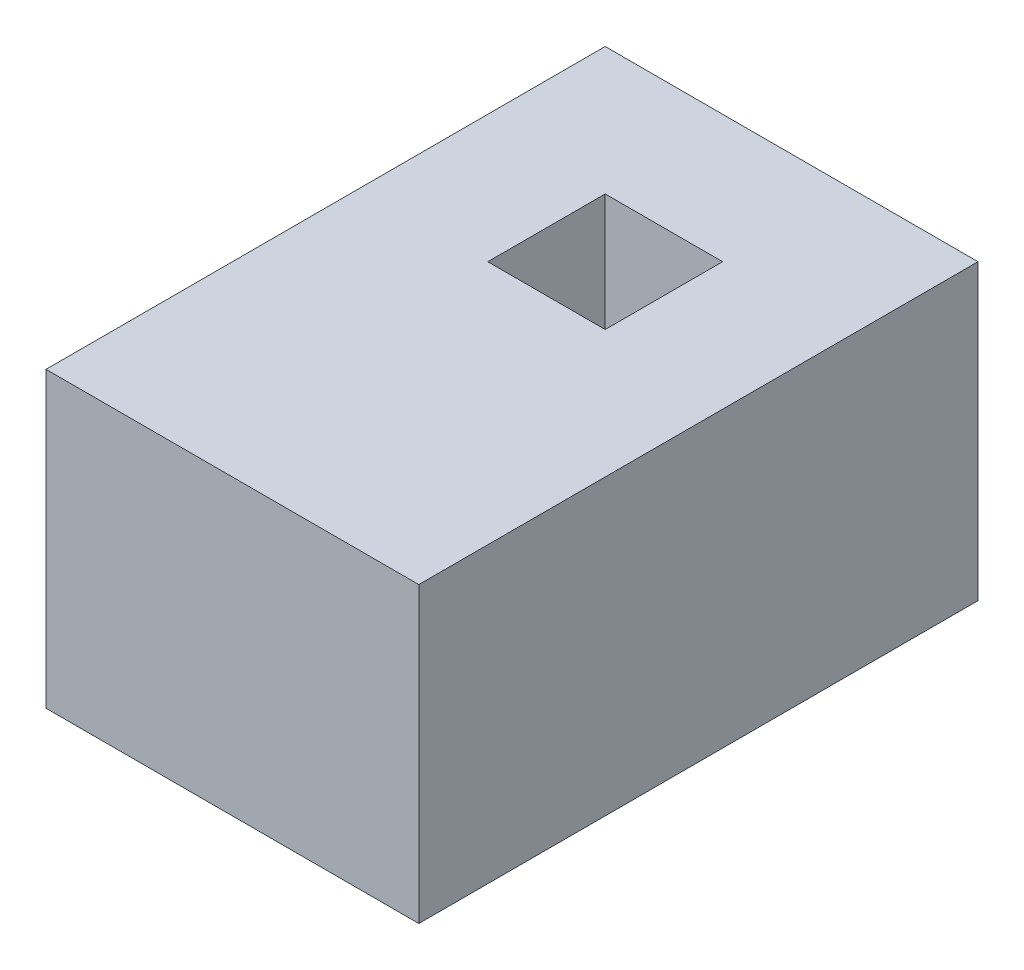
ISO-10303-21;
HEADER;
FILE_DESCRIPTION(('STEP AP214'),'2;1');
FILE_NAME('part.step','',(''),(''),'','','');
FILE_SCHEMA(('AUTOMOTIVE_DESIGN { 1 0 10303 214 1 1 1 1 }'));
ENDSEC;
DATA;
#1=APPLICATION_CONTEXT('core data for automotive mechanical design processes');
#2=APPLICATION_PROTOCOL_DEFINITION('international standard','automotive_design',2000,#1);
#3=PRODUCT_CONTEXT('',#1,'mechanical');
#4=PRODUCT('Part','Part','',(#3));
#5=PRODUCT_RELATED_PRODUCT_CATEGORY('part','',(#4));
#6=PRODUCT_DEFINITION_FORMATION('','',#4);
#7=PRODUCT_DEFINITION_CONTEXT('part definition',#1,'design');
#8=PRODUCT_DEFINITION('design','',#6,#7);
#9=PRODUCT_DEFINITION_SHAPE('','',#8);
#10=(LENGTH_UNIT() NAMED_UNIT(*) SI_UNIT(.MILLI.,.METRE.));
#11=(NAMED_UNIT(*) PLANE_ANGLE_UNIT() SI_UNIT($,.RADIAN.));
#12=(NAMED_UNIT(*) SI_UNIT($,.STERADIAN.) SOLID_ANGLE_UNIT());
#13=UNCERTAINTY_MEASURE_WITH_UNIT(LENGTH_MEASURE(1.E-05),#10,'distance_accuracy_value','');
#14=(GEOMETRIC_REPRESENTATION_CONTEXT(3) GLOBAL_UNCERTAINTY_ASSIGNED_CONTEXT((#13)) GLOBAL_UNIT_ASSIGNED_CONTEXT((#10,
#11,#12)) REPRESENTATION_CONTEXT('',''));
#15=CARTESIAN_POINT('',(0.,0.,0.));
#16=DIRECTION('',(0.,0.,1.));
#17=DIRECTION('',(1.,0.,0.));
#18=AXIS2_PLACEMENT_3D('',#15,#16,#17);
#19=CARTESIAN_POINT('',(0.,1.,0.));
#20=DIRECTION('',(0.,-1.,0.));
#21=DIRECTION('',(0.,0.,-1.));
#22=AXIS2_PLACEMENT_3D('',#19,#20,#21);
#23=PLANE('',#22);
#24=DIRECTION('',(0.,0.,-1.));
#25=VECTOR('',#24,1.);
#26=CARTESIAN_POINT('',(0.634999999999997,1.,0.952499999999988));
#27=LINE('',#26,#25);
#28=CARTESIAN_POINT('',(0.634999999999997,1.,0.952499999999988));
#29=VERTEX_POINT('',#28);
#30=CARTESIAN_POINT('',(0.634999999999997,1.,-0.952500000000002));
#31=VERTEX_POINT('',#30);
#32=EDGE_CURVE('E134',#29,#31,#27,.T.);
#33=ORIENTED_EDGE('',*,*,#32,.T.);
#34=DIRECTION('',(-1.,0.,0.));
#35=VECTOR('',#34,1.);
#36=CARTESIAN_POINT('',(-0.635000000000003,1.,-0.952500000000002));
#37=LINE('',#36,#35);
#38=CARTESIAN_POINT('',(-0.635000000000003,1.,-0.952500000000002));
#39=VERTEX_POINT('',#38);
#40=EDGE_CURVE('E137',#31,#39,#37,.T.);
#41=ORIENTED_EDGE('',*,*,#40,.T.);
#42=DIRECTION('',(0.,0.,1.));
#43=VECTOR('',#42,1.);
#44=CARTESIAN_POINT('',(-0.635000000000003,1.,0.952499999999988));
#45=LINE('',#44,#43);
#46=CARTESIAN_POINT('',(-0.635000000000003,1.,0.952499999999988));
#47=VERTEX_POINT('',#46);
#48=EDGE_CURVE('E140',#39,#47,#45,.T.);
#49=ORIENTED_EDGE('',*,*,#48,.T.);
#50=DIRECTION('',(1.,0.,0.));
#51=VECTOR('',#50,1.);
#52=CARTESIAN_POINT('',(-0.635000000000003,1.,0.952499999999988));
#53=LINE('',#52,#51);
#54=EDGE_CURVE('E142',#47,#29,#53,.T.);
#55=ORIENTED_EDGE('',*,*,#54,.T.);
#56=EDGE_LOOP('',(#33,#41,#49,#55));
#57=FACE_BOUND('',#56,.T.);
#58=DIRECTION('',(0.,0.,-1.));
#59=VECTOR('',#58,1.);
#60=CARTESIAN_POINT('',(0.2,1.,-0.517500000000002));
#61=LINE('',#60,#59);
#62=CARTESIAN_POINT('',(0.2,1.,-0.117500000000002));
#63=VERTEX_POINT('',#62);
#64=CARTESIAN_POINT('',(0.2,1.,-0.517500000000002));
#65=VERTEX_POINT('',#64);
#66=EDGE_CURVE('E98',#63,#65,#61,.T.);
#67=ORIENTED_EDGE('',*,*,#66,.F.);
#68=DIRECTION('',(1.,0.,0.));
#69=VECTOR('',#68,1.);
#70=CARTESIAN_POINT('',(-0.2,1.,-0.117500000000002));
#71=LINE('',#70,#69);
#72=CARTESIAN_POINT('',(-0.2,1.,-0.117500000000002));
#73=VERTEX_POINT('',#72);
#74=EDGE_CURVE('E120',#73,#63,#71,.T.);
#75=ORIENTED_EDGE('',*,*,#74,.F.);
#76=DIRECTION('',(0.,0.,1.));
#77=VECTOR('',#76,1.);
#78=CARTESIAN_POINT('',(-0.2,1.,-0.517500000000002));
#79=LINE('',#78,#77);
#80=CARTESIAN_POINT('',(-0.2,1.,-0.517500000000002));
#81=VERTEX_POINT('',#80);
#82=EDGE_CURVE('E118',#81,#73,#79,.T.);
#83=ORIENTED_EDGE('',*,*,#82,.F.);
#84=DIRECTION('',(-1.,0.,0.));
#85=VECTOR('',#84,1.);
#86=CARTESIAN_POINT('',(-0.2,1.,-0.517500000000002));
#87=LINE('',#86,#85);
#88=EDGE_CURVE('E106',#65,#81,#87,.T.);
#89=ORIENTED_EDGE('',*,*,#88,.F.);
#90=EDGE_LOOP('',(#67,#75,#83,#89));
#91=FACE_BOUND('',#90,.T.);
#92=ADVANCED_FACE('F33',(#57,#91),#23,.F.);
#93=CARTESIAN_POINT('',(0.,0.,0.));
#94=DIRECTION('',(0.,-1.,0.));
#95=DIRECTION('',(0.,0.,-1.));
#96=AXIS2_PLACEMENT_3D('',#93,#94,#95);
#97=PLANE('',#96);
#98=DIRECTION('',(0.,0.,-1.));
#99=VECTOR('',#98,1.);
#100=CARTESIAN_POINT('',(0.634999999999997,0.,0.952499999999988));
#101=LINE('',#100,#99);
#102=CARTESIAN_POINT('',(0.634999999999997,0.,0.952499999999988));
#103=VERTEX_POINT('',#102);
#104=CARTESIAN_POINT('',(0.634999999999997,0.,-0.952500000000002));
#105=VERTEX_POINT('',#104);
#106=EDGE_CURVE('E114',#103,#105,#101,.T.);
#107=ORIENTED_EDGE('',*,*,#106,.F.);
#108=DIRECTION('',(1.,0.,0.));
#109=VECTOR('',#108,1.);
#110=CARTESIAN_POINT('',(-0.635000000000003,0.,0.952499999999988));
#111=LINE('',#110,#109);
#112=CARTESIAN_POINT('',(-0.635000000000003,0.,0.952499999999988));
#113=VERTEX_POINT('',#112);
#114=EDGE_CURVE('E138',#113,#103,#111,.T.);
#115=ORIENTED_EDGE('',*,*,#114,.F.);
#116=DIRECTION('',(0.,0.,1.));
#117=VECTOR('',#116,1.);
#118=CARTESIAN_POINT('',(-0.635000000000003,0.,0.952499999999988));
#119=LINE('',#118,#117);
#120=CARTESIAN_POINT('',(-0.635000000000003,0.,-0.952500000000002));
#121=VERTEX_POINT('',#120);
#122=EDGE_CURVE('E149',#121,#113,#119,.T.);
#123=ORIENTED_EDGE('',*,*,#122,.F.);
#124=DIRECTION('',(-1.,0.,0.));
#125=VECTOR('',#124,1.);
#126=CARTESIAN_POINT('',(-0.635000000000003,0.,-0.952500000000002));
#127=LINE('',#126,#125);
#128=EDGE_CURVE('E147',#105,#121,#127,.T.);
#129=ORIENTED_EDGE('',*,*,#128,.F.);
#130=EDGE_LOOP('',(#107,#115,#123,#129));
#131=FACE_BOUND('',#130,.T.);
#132=DIRECTION('',(1.,0.,0.));
#133=VECTOR('',#132,1.);
#134=CARTESIAN_POINT('',(-0.2,0.,-0.117500000000002));
#135=LINE('',#134,#133);
#136=CARTESIAN_POINT('',(-0.2,0.,-0.117500000000002));
#137=VERTEX_POINT('',#136);
#138=CARTESIAN_POINT('',(0.2,0.,-0.117500000000002));
#139=VERTEX_POINT('',#138);
#140=EDGE_CURVE('E107',#137,#139,#135,.T.);
#141=ORIENTED_EDGE('',*,*,#140,.T.);
#142=DIRECTION('',(0.,0.,-1.));
#143=VECTOR('',#142,1.);
#144=CARTESIAN_POINT('',(0.2,0.,-0.517500000000002));
#145=LINE('',#144,#143);
#146=CARTESIAN_POINT('',(0.2,0.,-0.517500000000002));
#147=VERTEX_POINT('',#146);
#148=EDGE_CURVE('E56',#139,#147,#145,.T.);
#149=ORIENTED_EDGE('',*,*,#148,.T.);
#150=DIRECTION('',(-1.,0.,0.));
#151=VECTOR('',#150,1.);
#152=CARTESIAN_POINT('',(-0.2,0.,-0.517500000000002));
#153=LINE('',#152,#151);
#154=CARTESIAN_POINT('',(-0.2,0.,-0.517500000000002));
#155=VERTEX_POINT('',#154);
#156=EDGE_CURVE('E113',#147,#155,#153,.T.);
#157=ORIENTED_EDGE('',*,*,#156,.T.);
#158=DIRECTION('',(0.,0.,1.));
#159=VECTOR('',#158,1.);
#160=CARTESIAN_POINT('',(-0.2,0.,-0.517500000000002));
#161=LINE('',#160,#159);
#162=EDGE_CURVE('E126',#155,#137,#161,.T.);
#163=ORIENTED_EDGE('',*,*,#162,.T.);
#164=EDGE_LOOP('',(#141,#149,#157,#163));
#165=FACE_BOUND('',#164,.T.);
#166=ADVANCED_FACE('F167',(#131,#165),#97,.T.);
#167=CARTESIAN_POINT('',(0.634999999999997,1.,0.952499999999988));
#168=DIRECTION('',(-1.,0.,0.));
#169=DIRECTION('',(0.,0.,1.));
#170=AXIS2_PLACEMENT_3D('',#167,#168,#169);
#171=PLANE('',#170);
#172=ORIENTED_EDGE('',*,*,#106,.T.);
#173=DIRECTION('',(0.,-1.,0.));
#174=VECTOR('',#173,1.);
#175=CARTESIAN_POINT('',(0.634999999999997,1.,-0.952500000000002));
#176=LINE('',#175,#174);
#177=EDGE_CURVE('E11',#31,#105,#176,.T.);
#178=ORIENTED_EDGE('',*,*,#177,.F.);
#179=ORIENTED_EDGE('',*,*,#32,.F.);
#180=DIRECTION('',(0.,-1.,0.));
#181=VECTOR('',#180,1.);
#182=CARTESIAN_POINT('',(0.634999999999997,1.,0.952499999999988));
#183=LINE('',#182,#181);
#184=EDGE_CURVE('E144',#29,#103,#183,.T.);
#185=ORIENTED_EDGE('',*,*,#184,.T.);
#186=EDGE_LOOP('',(#172,#178,#179,#185));
#187=FACE_BOUND('',#186,.T.);
#188=ADVANCED_FACE('F35',(#187),#171,.F.);
#189=CARTESIAN_POINT('',(-0.635000000000003,1.,-0.952500000000002));
#190=DIRECTION('',(0.,0.,1.));
#191=DIRECTION('',(1.,0.,0.));
#192=AXIS2_PLACEMENT_3D('',#189,#190,#191);
#193=PLANE('',#192);
#194=ORIENTED_EDGE('',*,*,#128,.T.);
#195=DIRECTION('',(0.,-1.,0.));
#196=VECTOR('',#195,1.);
#197=CARTESIAN_POINT('',(-0.635000000000003,1.,-0.952500000000002));
#198=LINE('',#197,#196);
#199=EDGE_CURVE('E41',#39,#121,#198,.T.);
#200=ORIENTED_EDGE('',*,*,#199,.F.);
#201=ORIENTED_EDGE('',*,*,#40,.F.);
#202=ORIENTED_EDGE('',*,*,#177,.T.);
#203=EDGE_LOOP('',(#194,#200,#201,#202));
#204=FACE_BOUND('',#203,.T.);
#205=ADVANCED_FACE('F177',(#204),#193,.F.);
#206=CARTESIAN_POINT('',(-0.635000000000003,1.,0.952499999999988));
#207=DIRECTION('',(1.,0.,0.));
#208=DIRECTION('',(0.,0.,-1.));
#209=AXIS2_PLACEMENT_3D('',#206,#207,#208);
#210=PLANE('',#209);
#211=ORIENTED_EDGE('',*,*,#122,.T.);
#212=DIRECTION('',(0.,-1.,0.));
#213=VECTOR('',#212,1.);
#214=CARTESIAN_POINT('',(-0.635000000000003,1.,0.952499999999988));
#215=LINE('',#214,#213);
#216=EDGE_CURVE('E154',#47,#113,#215,.T.);
#217=ORIENTED_EDGE('',*,*,#216,.F.);
#218=ORIENTED_EDGE('',*,*,#48,.F.);
#219=ORIENTED_EDGE('',*,*,#199,.T.);
#220=EDGE_LOOP('',(#211,#217,#218,#219));
#221=FACE_BOUND('',#220,.T.);
#222=ADVANCED_FACE('F161',(#221),#210,.F.);
#223=CARTESIAN_POINT('',(-0.635000000000003,1.,0.952499999999988));
#224=DIRECTION('',(0.,0.,-1.));
#225=DIRECTION('',(-1.,0.,0.));
#226=AXIS2_PLACEMENT_3D('',#223,#224,#225);
#227=PLANE('',#226);
#228=ORIENTED_EDGE('',*,*,#114,.T.);
#229=ORIENTED_EDGE('',*,*,#184,.F.);
#230=ORIENTED_EDGE('',*,*,#54,.F.);
#231=ORIENTED_EDGE('',*,*,#216,.T.);
#232=EDGE_LOOP('',(#228,#229,#230,#231));
#233=FACE_BOUND('',#232,.T.);
#234=ADVANCED_FACE('F171',(#233),#227,.F.);
#235=CARTESIAN_POINT('',(0.2,1.,-0.517500000000002));
#236=DIRECTION('',(-1.,0.,0.));
#237=DIRECTION('',(0.,0.,1.));
#238=AXIS2_PLACEMENT_3D('',#235,#236,#237);
#239=PLANE('',#238);
#240=ORIENTED_EDGE('',*,*,#148,.F.);
#241=DIRECTION('',(0.,-1.,0.));
#242=VECTOR('',#241,1.);
#243=CARTESIAN_POINT('',(0.2,1.,-0.117500000000002));
#244=LINE('',#243,#242);
#245=EDGE_CURVE('E102',#63,#139,#244,.T.);
#246=ORIENTED_EDGE('',*,*,#245,.F.);
#247=ORIENTED_EDGE('',*,*,#66,.T.);
#248=DIRECTION('',(0.,-1.,0.));
#249=VECTOR('',#248,1.);
#250=CARTESIAN_POINT('',(0.2,1.,-0.517500000000002));
#251=LINE('',#250,#249);
#252=EDGE_CURVE('E101',#65,#147,#251,.T.);
#253=ORIENTED_EDGE('',*,*,#252,.T.);
#254=EDGE_LOOP('',(#240,#246,#247,#253));
#255=FACE_BOUND('',#254,.T.);
#256=ADVANCED_FACE('F100',(#255),#239,.T.);
#257=CARTESIAN_POINT('',(-0.2,1.,-0.517500000000002));
#258=DIRECTION('',(0.,0.,1.));
#259=DIRECTION('',(1.,0.,0.));
#260=AXIS2_PLACEMENT_3D('',#257,#258,#259);
#261=PLANE('',#260);
#262=ORIENTED_EDGE('',*,*,#156,.F.);
#263=ORIENTED_EDGE('',*,*,#252,.F.);
#264=ORIENTED_EDGE('',*,*,#88,.T.);
#265=DIRECTION('',(0.,-1.,0.));
#266=VECTOR('',#265,1.);
#267=CARTESIAN_POINT('',(-0.2,1.,-0.517500000000002));
#268=LINE('',#267,#266);
#269=EDGE_CURVE('E115',#81,#155,#268,.T.);
#270=ORIENTED_EDGE('',*,*,#269,.T.);
#271=EDGE_LOOP('',(#262,#263,#264,#270));
#272=FACE_BOUND('',#271,.T.);
#273=ADVANCED_FACE('F110',(#272),#261,.T.);
#274=CARTESIAN_POINT('',(-0.2,1.,-0.517500000000002));
#275=DIRECTION('',(1.,0.,0.));
#276=DIRECTION('',(0.,0.,-1.));
#277=AXIS2_PLACEMENT_3D('',#274,#275,#276);
#278=PLANE('',#277);
#279=ORIENTED_EDGE('',*,*,#162,.F.);
#280=ORIENTED_EDGE('',*,*,#269,.F.);
#281=ORIENTED_EDGE('',*,*,#82,.T.);
#282=DIRECTION('',(0.,-1.,0.));
#283=VECTOR('',#282,1.);
#284=CARTESIAN_POINT('',(-0.2,1.,-0.117500000000002));
#285=LINE('',#284,#283);
#286=EDGE_CURVE('E48',#73,#137,#285,.T.);
#287=ORIENTED_EDGE('',*,*,#286,.T.);
#288=EDGE_LOOP('',(#279,#280,#281,#287));
#289=FACE_BOUND('',#288,.T.);
#290=ADVANCED_FACE('F200',(#289),#278,.T.);
#291=CARTESIAN_POINT('',(-0.2,1.,-0.117500000000002));
#292=DIRECTION('',(0.,0.,-1.));
#293=DIRECTION('',(-1.,0.,0.));
#294=AXIS2_PLACEMENT_3D('',#291,#292,#293);
#295=PLANE('',#294);
#296=ORIENTED_EDGE('',*,*,#140,.F.);
#297=ORIENTED_EDGE('',*,*,#286,.F.);
#298=ORIENTED_EDGE('',*,*,#74,.T.);
#299=ORIENTED_EDGE('',*,*,#245,.T.);
#300=EDGE_LOOP('',(#296,#297,#298,#299));
#301=FACE_BOUND('',#300,.T.);
#302=ADVANCED_FACE('F204',(#301),#295,.T.);
#303=CLOSED_SHELL('',(#92,#166,#188,#205,#222,#234,#256,#273,#290,#302));
#304=MANIFOLD_SOLID_BREP('B2',#303);
#305=ADVANCED_BREP_SHAPE_REPRESENTATION('',(#18,#304),#14);
#306=SHAPE_DEFINITION_REPRESENTATION(#9,#305);
ENDSEC;
END-ISO-10303-21;
